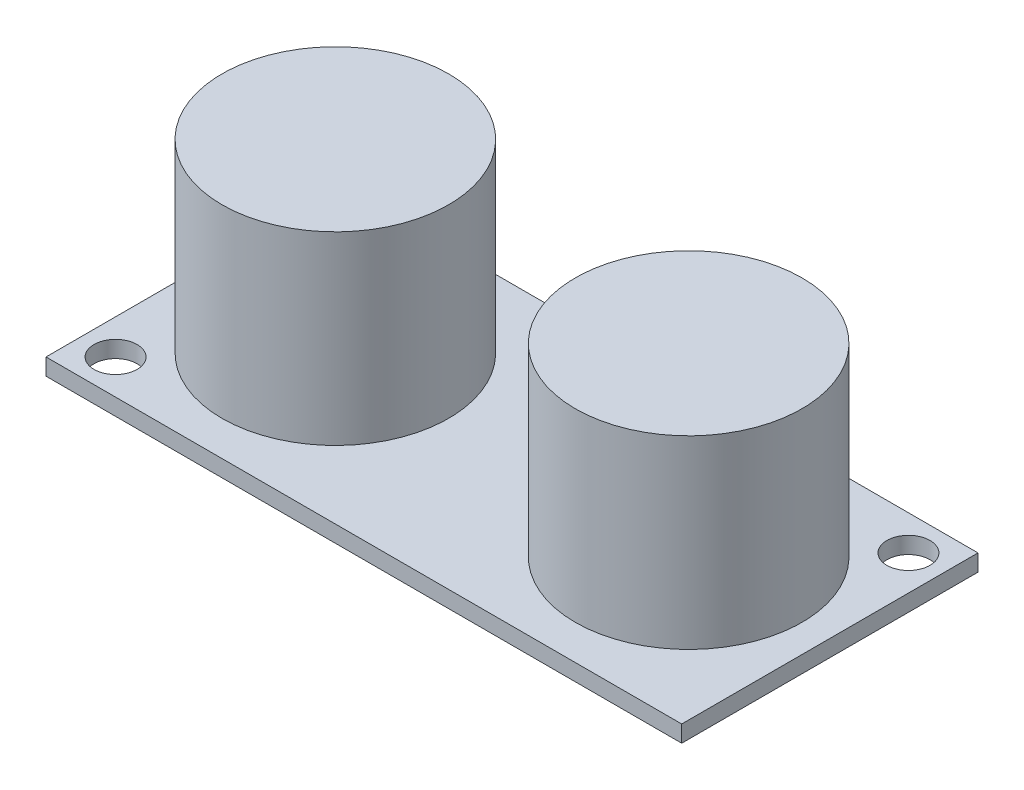
ISO-10303-21;
HEADER;
FILE_DESCRIPTION(('STEP AP214'),'2;1');
FILE_NAME('part.step','',(''),(''),'','','');
FILE_SCHEMA(('AUTOMOTIVE_DESIGN { 1 0 10303 214 1 1 1 1 }'));
ENDSEC;
DATA;
#1=APPLICATION_CONTEXT('core data for automotive mechanical design processes');
#2=APPLICATION_PROTOCOL_DEFINITION('international standard','automotive_design',2000,#1);
#3=PRODUCT_CONTEXT('',#1,'mechanical');
#4=PRODUCT('Part','Part','',(#3));
#5=PRODUCT_RELATED_PRODUCT_CATEGORY('part','',(#4));
#6=PRODUCT_DEFINITION_FORMATION('','',#4);
#7=PRODUCT_DEFINITION_CONTEXT('part definition',#1,'design');
#8=PRODUCT_DEFINITION('design','',#6,#7);
#9=PRODUCT_DEFINITION_SHAPE('','',#8);
#10=(LENGTH_UNIT() NAMED_UNIT(*) SI_UNIT(.MILLI.,.METRE.));
#11=(NAMED_UNIT(*) PLANE_ANGLE_UNIT() SI_UNIT($,.RADIAN.));
#12=(NAMED_UNIT(*) SI_UNIT($,.STERADIAN.) SOLID_ANGLE_UNIT());
#13=UNCERTAINTY_MEASURE_WITH_UNIT(LENGTH_MEASURE(1.E-05),#10,'distance_accuracy_value','');
#14=(GEOMETRIC_REPRESENTATION_CONTEXT(3) GLOBAL_UNCERTAINTY_ASSIGNED_CONTEXT((#13)) GLOBAL_UNIT_ASSIGNED_CONTEXT((#10,
#11,#12)) REPRESENTATION_CONTEXT('',''));
#15=CARTESIAN_POINT('',(0.,0.,0.));
#16=DIRECTION('',(0.,0.,1.));
#17=DIRECTION('',(1.,0.,0.));
#18=AXIS2_PLACEMENT_3D('',#15,#16,#17);
#19=CARTESIAN_POINT('',(0.,1.2,0.));
#20=DIRECTION('',(0.,-1.,0.));
#21=DIRECTION('',(0.,0.,-1.));
#22=AXIS2_PLACEMENT_3D('',#19,#20,#21);
#23=PLANE('',#22);
#24=CARTESIAN_POINT('',(12.7,1.2,0.));
#25=DIRECTION('',(0.,-1.,0.));
#26=DIRECTION('',(0.,0.,-1.));
#27=AXIS2_PLACEMENT_3D('',#24,#25,#26);
#28=CIRCLE('',#27,8.15);
#29=CARTESIAN_POINT('',(12.7,1.2,-8.15));
#30=VERTEX_POINT('',#29);
#31=EDGE_CURVE('E11',#30,#30,#28,.F.);
#32=ORIENTED_EDGE('',*,*,#31,.F.);
#33=EDGE_LOOP('',(#32));
#34=FACE_BOUND('',#33,.T.);
#35=CARTESIAN_POINT('',(-12.7,1.2,0.));
#36=DIRECTION('',(0.,-1.,0.));
#37=DIRECTION('',(0.,0.,-1.));
#38=AXIS2_PLACEMENT_3D('',#35,#36,#37);
#39=CIRCLE('',#38,8.15);
#40=CARTESIAN_POINT('',(-12.7,1.2,-8.15));
#41=VERTEX_POINT('',#40);
#42=EDGE_CURVE('E41',#41,#41,#39,.F.);
#43=ORIENTED_EDGE('',*,*,#42,.F.);
#44=EDGE_LOOP('',(#43));
#45=FACE_BOUND('',#44,.T.);
#46=DIRECTION('',(0.,0.,-1.));
#47=VECTOR('',#46,1.);
#48=CARTESIAN_POINT('',(22.85,1.2,10.65));
#49=LINE('',#48,#47);
#50=CARTESIAN_POINT('',(22.85,1.2,10.65));
#51=VERTEX_POINT('',#50);
#52=CARTESIAN_POINT('',(22.85,1.2,-10.65));
#53=VERTEX_POINT('',#52);
#54=EDGE_CURVE('E85',#51,#53,#49,.T.);
#55=ORIENTED_EDGE('',*,*,#54,.T.);
#56=DIRECTION('',(-1.,0.,0.));
#57=VECTOR('',#56,1.);
#58=CARTESIAN_POINT('',(-22.85,1.2,-10.65));
#59=LINE('',#58,#57);
#60=CARTESIAN_POINT('',(-22.85,1.2,-10.65));
#61=VERTEX_POINT('',#60);
#62=EDGE_CURVE('E80',#53,#61,#59,.T.);
#63=ORIENTED_EDGE('',*,*,#62,.T.);
#64=DIRECTION('',(0.,0.,1.));
#65=VECTOR('',#64,1.);
#66=CARTESIAN_POINT('',(-22.85,1.2,10.65));
#67=LINE('',#66,#65);
#68=CARTESIAN_POINT('',(-22.85,1.2,10.65));
#69=VERTEX_POINT('',#68);
#70=EDGE_CURVE('E83',#61,#69,#67,.T.);
#71=ORIENTED_EDGE('',*,*,#70,.T.);
#72=DIRECTION('',(1.,0.,0.));
#73=VECTOR('',#72,1.);
#74=CARTESIAN_POINT('',(-22.85,1.2,10.65));
#75=LINE('',#74,#73);
#76=EDGE_CURVE('E49',#69,#51,#75,.T.);
#77=ORIENTED_EDGE('',*,*,#76,.T.);
#78=EDGE_LOOP('',(#55,#63,#71,#77));
#79=FACE_BOUND('',#78,.T.);
#80=CARTESIAN_POINT('',(20.35,1.2,-8.14999999999999));
#81=DIRECTION('',(0.,1.,0.));
#82=DIRECTION('',(0.,0.,1.));
#83=AXIS2_PLACEMENT_3D('',#80,#81,#82);
#84=CIRCLE('',#83,1.55);
#85=CARTESIAN_POINT('',(20.35,1.2,-6.59999999999999));
#86=VERTEX_POINT('',#85);
#87=EDGE_CURVE('E103',#86,#86,#84,.T.);
#88=ORIENTED_EDGE('',*,*,#87,.F.);
#89=EDGE_LOOP('',(#88));
#90=FACE_BOUND('',#89,.T.);
#91=CARTESIAN_POINT('',(-20.35,1.2,8.15));
#92=DIRECTION('',(0.,1.,0.));
#93=DIRECTION('',(0.,0.,1.));
#94=AXIS2_PLACEMENT_3D('',#91,#92,#93);
#95=CIRCLE('',#94,1.55);
#96=CARTESIAN_POINT('',(-20.35,1.2,9.7));
#97=VERTEX_POINT('',#96);
#98=EDGE_CURVE('E146',#97,#97,#95,.T.);
#99=ORIENTED_EDGE('',*,*,#98,.F.);
#100=EDGE_LOOP('',(#99));
#101=FACE_BOUND('',#100,.T.);
#102=ADVANCED_FACE('F32',(#34,#45,#79,#90,#101),#23,.F.);
#103=CARTESIAN_POINT('',(0.,0.,0.));
#104=DIRECTION('',(0.,-1.,0.));
#105=DIRECTION('',(0.,0.,-1.));
#106=AXIS2_PLACEMENT_3D('',#103,#104,#105);
#107=PLANE('',#106);
#108=CARTESIAN_POINT('',(20.35,0.,-8.14999999999999));
#109=DIRECTION('',(0.,1.,0.));
#110=DIRECTION('',(0.,0.,1.));
#111=AXIS2_PLACEMENT_3D('',#108,#109,#110);
#112=CIRCLE('',#111,1.55);
#113=CARTESIAN_POINT('',(20.35,0.,-6.59999999999999));
#114=VERTEX_POINT('',#113);
#115=EDGE_CURVE('E150',#114,#114,#112,.T.);
#116=ORIENTED_EDGE('',*,*,#115,.T.);
#117=EDGE_LOOP('',(#116));
#118=FACE_BOUND('',#117,.T.);
#119=DIRECTION('',(0.,0.,-1.));
#120=VECTOR('',#119,1.);
#121=CARTESIAN_POINT('',(22.85,0.,10.65));
#122=LINE('',#121,#120);
#123=CARTESIAN_POINT('',(22.85,0.,10.65));
#124=VERTEX_POINT('',#123);
#125=CARTESIAN_POINT('',(22.85,0.,-10.65));
#126=VERTEX_POINT('',#125);
#127=EDGE_CURVE('E100',#124,#126,#122,.T.);
#128=ORIENTED_EDGE('',*,*,#127,.F.);
#129=DIRECTION('',(1.,0.,0.));
#130=VECTOR('',#129,1.);
#131=CARTESIAN_POINT('',(-22.85,0.,10.65));
#132=LINE('',#131,#130);
#133=CARTESIAN_POINT('',(-22.85,0.,10.65));
#134=VERTEX_POINT('',#133);
#135=EDGE_CURVE('E72',#134,#124,#132,.T.);
#136=ORIENTED_EDGE('',*,*,#135,.F.);
#137=DIRECTION('',(0.,0.,1.));
#138=VECTOR('',#137,1.);
#139=CARTESIAN_POINT('',(-22.85,0.,10.65));
#140=LINE('',#139,#138);
#141=CARTESIAN_POINT('',(-22.85,0.,-10.65));
#142=VERTEX_POINT('',#141);
#143=EDGE_CURVE('E66',#142,#134,#140,.T.);
#144=ORIENTED_EDGE('',*,*,#143,.F.);
#145=DIRECTION('',(-1.,0.,0.));
#146=VECTOR('',#145,1.);
#147=CARTESIAN_POINT('',(-22.85,0.,-10.65));
#148=LINE('',#147,#146);
#149=EDGE_CURVE('E90',#126,#142,#148,.T.);
#150=ORIENTED_EDGE('',*,*,#149,.F.);
#151=EDGE_LOOP('',(#128,#136,#144,#150));
#152=FACE_BOUND('',#151,.T.);
#153=CARTESIAN_POINT('',(-20.35,0.,8.15));
#154=DIRECTION('',(0.,1.,0.));
#155=DIRECTION('',(0.,0.,1.));
#156=AXIS2_PLACEMENT_3D('',#153,#154,#155);
#157=CIRCLE('',#156,1.55);
#158=CARTESIAN_POINT('',(-20.35,0.,9.7));
#159=VERTEX_POINT('',#158);
#160=EDGE_CURVE('E144',#159,#159,#157,.T.);
#161=ORIENTED_EDGE('',*,*,#160,.T.);
#162=EDGE_LOOP('',(#161));
#163=FACE_BOUND('',#162,.T.);
#164=ADVANCED_FACE('F115',(#118,#152,#163),#107,.T.);
#165=CARTESIAN_POINT('',(22.85,1.2,10.65));
#166=DIRECTION('',(-1.,0.,0.));
#167=DIRECTION('',(0.,0.,1.));
#168=AXIS2_PLACEMENT_3D('',#165,#166,#167);
#169=PLANE('',#168);
#170=ORIENTED_EDGE('',*,*,#127,.T.);
#171=DIRECTION('',(0.,-1.,0.));
#172=VECTOR('',#171,1.);
#173=CARTESIAN_POINT('',(22.85,1.2,-10.65));
#174=LINE('',#173,#172);
#175=EDGE_CURVE('E91',#53,#126,#174,.T.);
#176=ORIENTED_EDGE('',*,*,#175,.F.);
#177=ORIENTED_EDGE('',*,*,#54,.F.);
#178=DIRECTION('',(0.,-1.,0.));
#179=VECTOR('',#178,1.);
#180=CARTESIAN_POINT('',(22.85,1.2,10.65));
#181=LINE('',#180,#179);
#182=EDGE_CURVE('E96',#51,#124,#181,.T.);
#183=ORIENTED_EDGE('',*,*,#182,.T.);
#184=EDGE_LOOP('',(#170,#176,#177,#183));
#185=FACE_BOUND('',#184,.T.);
#186=ADVANCED_FACE('F34',(#185),#169,.F.);
#187=CARTESIAN_POINT('',(-22.85,1.2,-10.65));
#188=DIRECTION('',(0.,0.,1.));
#189=DIRECTION('',(1.,0.,0.));
#190=AXIS2_PLACEMENT_3D('',#187,#188,#189);
#191=PLANE('',#190);
#192=ORIENTED_EDGE('',*,*,#149,.T.);
#193=DIRECTION('',(0.,-1.,0.));
#194=VECTOR('',#193,1.);
#195=CARTESIAN_POINT('',(-22.85,1.2,-10.65));
#196=LINE('',#195,#194);
#197=EDGE_CURVE('E88',#61,#142,#196,.T.);
#198=ORIENTED_EDGE('',*,*,#197,.F.);
#199=ORIENTED_EDGE('',*,*,#62,.F.);
#200=ORIENTED_EDGE('',*,*,#175,.T.);
#201=EDGE_LOOP('',(#192,#198,#199,#200));
#202=FACE_BOUND('',#201,.T.);
#203=ADVANCED_FACE('F89',(#202),#191,.F.);
#204=CARTESIAN_POINT('',(-22.85,1.2,10.65));
#205=DIRECTION('',(1.,0.,0.));
#206=DIRECTION('',(0.,0.,-1.));
#207=AXIS2_PLACEMENT_3D('',#204,#205,#206);
#208=PLANE('',#207);
#209=ORIENTED_EDGE('',*,*,#143,.T.);
#210=DIRECTION('',(0.,-1.,0.));
#211=VECTOR('',#210,1.);
#212=CARTESIAN_POINT('',(-22.85,1.2,10.65));
#213=LINE('',#212,#211);
#214=EDGE_CURVE('E92',#69,#134,#213,.T.);
#215=ORIENTED_EDGE('',*,*,#214,.F.);
#216=ORIENTED_EDGE('',*,*,#70,.F.);
#217=ORIENTED_EDGE('',*,*,#197,.T.);
#218=EDGE_LOOP('',(#209,#215,#216,#217));
#219=FACE_BOUND('',#218,.T.);
#220=ADVANCED_FACE('F94',(#219),#208,.F.);
#221=CARTESIAN_POINT('',(-22.85,1.2,10.65));
#222=DIRECTION('',(0.,0.,-1.));
#223=DIRECTION('',(-1.,0.,0.));
#224=AXIS2_PLACEMENT_3D('',#221,#222,#223);
#225=PLANE('',#224);
#226=ORIENTED_EDGE('',*,*,#135,.T.);
#227=ORIENTED_EDGE('',*,*,#182,.F.);
#228=ORIENTED_EDGE('',*,*,#76,.F.);
#229=ORIENTED_EDGE('',*,*,#214,.T.);
#230=EDGE_LOOP('',(#226,#227,#228,#229));
#231=FACE_BOUND('',#230,.T.);
#232=ADVANCED_FACE('F128',(#231),#225,.F.);
#233=CARTESIAN_POINT('',(20.35,1.2,-8.14999999999999));
#234=DIRECTION('',(0.,-1.,0.));
#235=DIRECTION('',(0.,0.,-1.));
#236=AXIS2_PLACEMENT_3D('',#233,#234,#235);
#237=CYLINDRICAL_SURFACE('',#236,1.55);
#238=ORIENTED_EDGE('',*,*,#87,.T.);
#239=EDGE_LOOP('',(#238));
#240=FACE_BOUND('',#239,.T.);
#241=ORIENTED_EDGE('',*,*,#115,.F.);
#242=EDGE_LOOP('',(#241));
#243=FACE_BOUND('',#242,.T.);
#244=ADVANCED_FACE('F125',(#240,#243),#237,.F.);
#245=CARTESIAN_POINT('',(-20.35,1.2,8.15));
#246=DIRECTION('',(0.,-1.,0.));
#247=DIRECTION('',(0.,0.,-1.));
#248=AXIS2_PLACEMENT_3D('',#245,#246,#247);
#249=CYLINDRICAL_SURFACE('',#248,1.55);
#250=ORIENTED_EDGE('',*,*,#98,.T.);
#251=EDGE_LOOP('',(#250));
#252=FACE_BOUND('',#251,.T.);
#253=ORIENTED_EDGE('',*,*,#160,.F.);
#254=EDGE_LOOP('',(#253));
#255=FACE_BOUND('',#254,.T.);
#256=ADVANCED_FACE('F162',(#252,#255),#249,.F.);
#257=CARTESIAN_POINT('',(-12.7,14.5,0.));
#258=DIRECTION('',(0.,-1.,0.));
#259=DIRECTION('',(0.,0.,-1.));
#260=AXIS2_PLACEMENT_3D('',#257,#258,#259);
#261=CYLINDRICAL_SURFACE('',#260,8.15);
#262=CARTESIAN_POINT('',(-12.7,14.5,0.));
#263=DIRECTION('',(0.,1.,0.));
#264=DIRECTION('',(0.,0.,1.));
#265=AXIS2_PLACEMENT_3D('',#262,#263,#264);
#266=CIRCLE('',#265,8.15);
#267=CARTESIAN_POINT('',(-12.7,14.5,8.15));
#268=VERTEX_POINT('',#267);
#269=EDGE_CURVE('E147',#268,#268,#266,.T.);
#270=ORIENTED_EDGE('',*,*,#269,.F.);
#271=EDGE_LOOP('',(#270));
#272=FACE_BOUND('',#271,.T.);
#273=ORIENTED_EDGE('',*,*,#42,.T.);
#274=EDGE_LOOP('',(#273));
#275=FACE_BOUND('',#274,.T.);
#276=ADVANCED_FACE('F112',(#272,#275),#261,.T.);
#277=CARTESIAN_POINT('',(-12.7,14.5,0.));
#278=DIRECTION('',(0.,1.,0.));
#279=DIRECTION('',(0.,0.,1.));
#280=AXIS2_PLACEMENT_3D('',#277,#278,#279);
#281=PLANE('',#280);
#282=ORIENTED_EDGE('',*,*,#269,.T.);
#283=EDGE_LOOP('',(#282));
#284=FACE_BOUND('',#283,.T.);
#285=ADVANCED_FACE('F174',(#284),#281,.T.);
#286=CARTESIAN_POINT('',(12.7,14.5,0.));
#287=DIRECTION('',(0.,-1.,0.));
#288=DIRECTION('',(0.,0.,-1.));
#289=AXIS2_PLACEMENT_3D('',#286,#287,#288);
#290=CYLINDRICAL_SURFACE('',#289,8.15);
#291=CARTESIAN_POINT('',(12.7,14.5,0.));
#292=DIRECTION('',(0.,1.,0.));
#293=DIRECTION('',(0.,0.,1.));
#294=AXIS2_PLACEMENT_3D('',#291,#292,#293);
#295=CIRCLE('',#294,8.15);
#296=CARTESIAN_POINT('',(12.7,14.5,8.15));
#297=VERTEX_POINT('',#296);
#298=EDGE_CURVE('E153',#297,#297,#295,.T.);
#299=ORIENTED_EDGE('',*,*,#298,.F.);
#300=EDGE_LOOP('',(#299));
#301=FACE_BOUND('',#300,.T.);
#302=ORIENTED_EDGE('',*,*,#31,.T.);
#303=EDGE_LOOP('',(#302));
#304=FACE_BOUND('',#303,.T.);
#305=ADVANCED_FACE('F180',(#301,#304),#290,.T.);
#306=CARTESIAN_POINT('',(12.7,14.5,0.));
#307=DIRECTION('',(0.,1.,0.));
#308=DIRECTION('',(0.,0.,1.));
#309=AXIS2_PLACEMENT_3D('',#306,#307,#308);
#310=PLANE('',#309);
#311=ORIENTED_EDGE('',*,*,#298,.T.);
#312=EDGE_LOOP('',(#311));
#313=FACE_BOUND('',#312,.T.);
#314=ADVANCED_FACE('F184',(#313),#310,.T.);
#315=CLOSED_SHELL('',(#102,#164,#186,#203,#220,#232,#244,#256,#276,#285,#305,#314));
#316=MANIFOLD_SOLID_BREP('B2',#315);
#317=ADVANCED_BREP_SHAPE_REPRESENTATION('',(#18,#316),#14);
#318=SHAPE_DEFINITION_REPRESENTATION(#9,#317);
ENDSEC;
END-ISO-10303-21;
